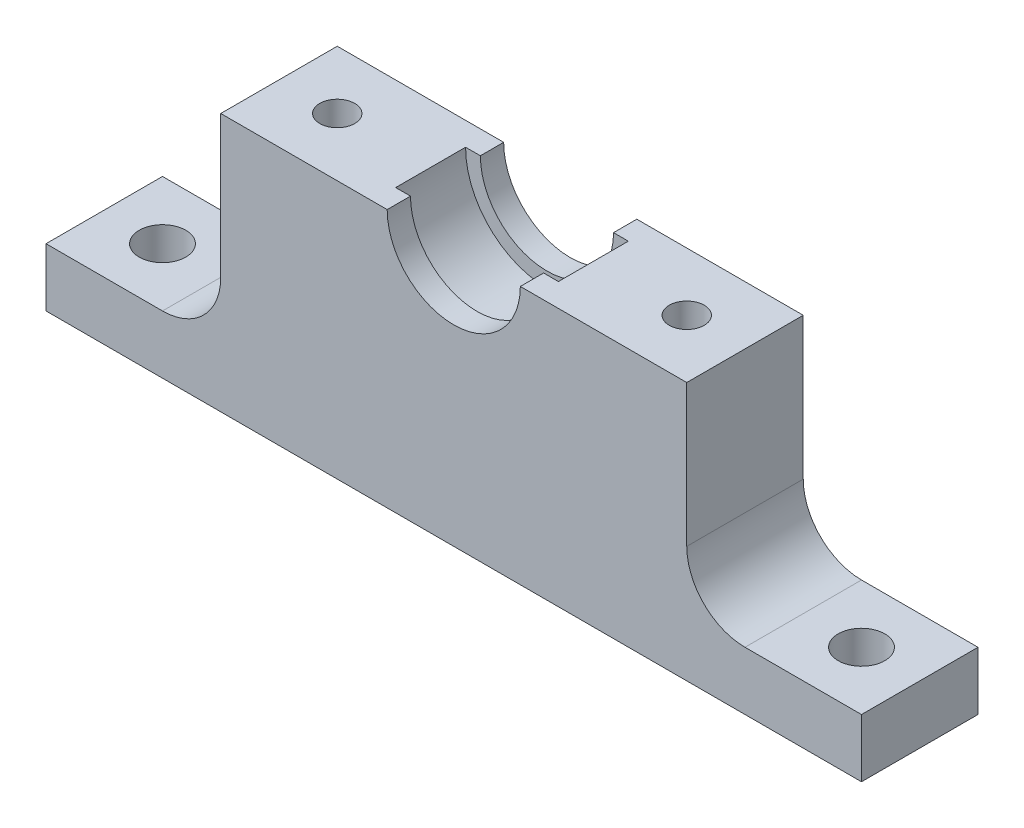
ISO-10303-21;
HEADER;
FILE_DESCRIPTION(('STEP AP214'),'2;1');
FILE_NAME('part.step','',(''),(''),'','','');
FILE_SCHEMA(('AUTOMOTIVE_DESIGN { 1 0 10303 214 1 1 1 1 }'));
ENDSEC;
DATA;
#1=APPLICATION_CONTEXT('core data for automotive mechanical design processes');
#2=APPLICATION_PROTOCOL_DEFINITION('international standard','automotive_design',2000,#1);
#3=PRODUCT_CONTEXT('',#1,'mechanical');
#4=PRODUCT('Part','Part','',(#3));
#5=PRODUCT_RELATED_PRODUCT_CATEGORY('part','',(#4));
#6=PRODUCT_DEFINITION_FORMATION('','',#4);
#7=PRODUCT_DEFINITION_CONTEXT('part definition',#1,'design');
#8=PRODUCT_DEFINITION('design','',#6,#7);
#9=PRODUCT_DEFINITION_SHAPE('','',#8);
#10=(LENGTH_UNIT() NAMED_UNIT(*) SI_UNIT(.MILLI.,.METRE.));
#11=(NAMED_UNIT(*) PLANE_ANGLE_UNIT() SI_UNIT($,.RADIAN.));
#12=(NAMED_UNIT(*) SI_UNIT($,.STERADIAN.) SOLID_ANGLE_UNIT());
#13=UNCERTAINTY_MEASURE_WITH_UNIT(LENGTH_MEASURE(1.E-05),#10,'distance_accuracy_value','');
#14=(GEOMETRIC_REPRESENTATION_CONTEXT(3) GLOBAL_UNCERTAINTY_ASSIGNED_CONTEXT((#13)) GLOBAL_UNIT_ASSIGNED_CONTEXT((#10,
#11,#12)) REPRESENTATION_CONTEXT('',''));
#15=CARTESIAN_POINT('',(0.,0.,0.));
#16=DIRECTION('',(0.,0.,1.));
#17=DIRECTION('',(1.,0.,0.));
#18=AXIS2_PLACEMENT_3D('',#15,#16,#17);
#19=CARTESIAN_POINT('',(0.,22.1798,0.));
#20=DIRECTION('',(0.,1.,0.));
#21=DIRECTION('',(0.,0.,1.));
#22=AXIS2_PLACEMENT_3D('',#19,#20,#21);
#23=PLANE('',#22);
#24=CARTESIAN_POINT('',(15.,22.1798,0.));
#25=DIRECTION('',(0.,1.,0.));
#26=DIRECTION('',(0.,0.,1.));
#27=AXIS2_PLACEMENT_3D('',#24,#25,#26);
#28=CIRCLE('',#27,1.5);
#29=CARTESIAN_POINT('',(15.,22.1798,1.5));
#30=VERTEX_POINT('',#29);
#31=EDGE_CURVE('E224',#30,#30,#28,.T.);
#32=ORIENTED_EDGE('',*,*,#31,.F.);
#33=EDGE_LOOP('',(#32));
#34=FACE_BOUND('',#33,.T.);
#35=DIRECTION('',(0.,0.,-1.));
#36=VECTOR('',#35,1.);
#37=CARTESIAN_POINT('',(5.715,22.1798,5.));
#38=LINE('',#37,#36);
#39=CARTESIAN_POINT('',(5.715,22.1798,5.));
#40=VERTEX_POINT('',#39);
#41=CARTESIAN_POINT('',(5.715,22.1798,3.));
#42=VERTEX_POINT('',#41);
#43=EDGE_CURVE('E242',#40,#42,#38,.T.);
#44=ORIENTED_EDGE('',*,*,#43,.F.);
#45=DIRECTION('',(1.,0.,0.));
#46=VECTOR('',#45,1.);
#47=CARTESIAN_POINT('',(20.,22.1798,5.));
#48=LINE('',#47,#46);
#49=CARTESIAN_POINT('',(20.,22.1798,5.));
#50=VERTEX_POINT('',#49);
#51=EDGE_CURVE('E282',#40,#50,#48,.T.);
#52=ORIENTED_EDGE('',*,*,#51,.T.);
#53=DIRECTION('',(0.,0.,-1.));
#54=VECTOR('',#53,1.);
#55=CARTESIAN_POINT('',(20.,22.1798,5.));
#56=LINE('',#55,#54);
#57=CARTESIAN_POINT('',(20.,22.1798,-5.));
#58=VERTEX_POINT('',#57);
#59=EDGE_CURVE('E288',#50,#58,#56,.T.);
#60=ORIENTED_EDGE('',*,*,#59,.T.);
#61=DIRECTION('',(-1.,0.,0.));
#62=VECTOR('',#61,1.);
#63=CARTESIAN_POINT('',(20.,22.1798,-5.));
#64=LINE('',#63,#62);
#65=CARTESIAN_POINT('',(5.715,22.1798,-5.));
#66=VERTEX_POINT('',#65);
#67=EDGE_CURVE('E292',#58,#66,#64,.T.);
#68=ORIENTED_EDGE('',*,*,#67,.T.);
#69=CARTESIAN_POINT('',(5.715,22.1798,-3.));
#70=VERTEX_POINT('',#69);
#71=EDGE_CURVE('E246',#70,#66,#38,.T.);
#72=ORIENTED_EDGE('',*,*,#71,.F.);
#73=DIRECTION('',(1.,0.,0.));
#74=VECTOR('',#73,1.);
#75=CARTESIAN_POINT('',(6.985,22.1798,-3.));
#76=LINE('',#75,#74);
#77=CARTESIAN_POINT('',(6.985,22.1798,-3.));
#78=VERTEX_POINT('',#77);
#79=EDGE_CURVE('E267',#70,#78,#76,.T.);
#80=ORIENTED_EDGE('',*,*,#79,.T.);
#81=DIRECTION('',(0.,0.,-1.));
#82=VECTOR('',#81,1.);
#83=CARTESIAN_POINT('',(6.985,22.1798,3.));
#84=LINE('',#83,#82);
#85=CARTESIAN_POINT('',(6.985,22.1798,3.));
#86=VERTEX_POINT('',#85);
#87=EDGE_CURVE('E271',#86,#78,#84,.T.);
#88=ORIENTED_EDGE('',*,*,#87,.F.);
#89=DIRECTION('',(1.,0.,0.));
#90=VECTOR('',#89,1.);
#91=CARTESIAN_POINT('',(6.985,22.1798,3.));
#92=LINE('',#91,#90);
#93=EDGE_CURVE('E258',#42,#86,#92,.T.);
#94=ORIENTED_EDGE('',*,*,#93,.F.);
#95=EDGE_LOOP('',(#44,#52,#60,#68,#72,#80,#88,#94));
#96=FACE_BOUND('',#95,.T.);
#97=ADVANCED_FACE('F39',(#34,#96),#23,.T.);
#98=CARTESIAN_POINT('',(-15.,22.1798,1.02348685082632E-13));
#99=DIRECTION('',(0.,1.,0.));
#100=DIRECTION('',(0.,0.,-1.));
#101=AXIS2_PLACEMENT_3D('',#98,#99,#100);
#102=CIRCLE('',#101,1.5);
#103=CARTESIAN_POINT('',(-15.,22.1798,-1.4999999999999));
#104=VERTEX_POINT('',#103);
#105=EDGE_CURVE('E216',#104,#104,#102,.T.);
#106=ORIENTED_EDGE('',*,*,#105,.F.);
#107=EDGE_LOOP('',(#106));
#108=FACE_BOUND('',#107,.T.);
#109=DIRECTION('',(0.,0.,-1.));
#110=VECTOR('',#109,1.);
#111=CARTESIAN_POINT('',(-5.715,22.1798,5.));
#112=LINE('',#111,#110);
#113=CARTESIAN_POINT('',(-5.715,22.1798,-3.));
#114=VERTEX_POINT('',#113);
#115=CARTESIAN_POINT('',(-5.715,22.1798,-5.));
#116=VERTEX_POINT('',#115);
#117=EDGE_CURVE('E239',#114,#116,#112,.T.);
#118=ORIENTED_EDGE('',*,*,#117,.T.);
#119=CARTESIAN_POINT('',(-20.,22.1798,-5.));
#120=VERTEX_POINT('',#119);
#121=EDGE_CURVE('E291',#116,#120,#64,.T.);
#122=ORIENTED_EDGE('',*,*,#121,.T.);
#123=DIRECTION('',(0.,0.,1.));
#124=VECTOR('',#123,1.);
#125=CARTESIAN_POINT('',(-20.,22.1798,5.));
#126=LINE('',#125,#124);
#127=CARTESIAN_POINT('',(-20.,22.1798,5.));
#128=VERTEX_POINT('',#127);
#129=EDGE_CURVE('E278',#120,#128,#126,.T.);
#130=ORIENTED_EDGE('',*,*,#129,.T.);
#131=CARTESIAN_POINT('',(-5.715,22.1798,5.));
#132=VERTEX_POINT('',#131);
#133=EDGE_CURVE('E284',#128,#132,#48,.T.);
#134=ORIENTED_EDGE('',*,*,#133,.T.);
#135=CARTESIAN_POINT('',(-5.715,22.1798,3.));
#136=VERTEX_POINT('',#135);
#137=EDGE_CURVE('E247',#132,#136,#112,.T.);
#138=ORIENTED_EDGE('',*,*,#137,.T.);
#139=CARTESIAN_POINT('',(-6.985,22.1798,3.));
#140=VERTEX_POINT('',#139);
#141=EDGE_CURVE('E260',#140,#136,#92,.T.);
#142=ORIENTED_EDGE('',*,*,#141,.F.);
#143=DIRECTION('',(0.,0.,-1.));
#144=VECTOR('',#143,1.);
#145=CARTESIAN_POINT('',(-6.985,22.1798,3.));
#146=LINE('',#145,#144);
#147=CARTESIAN_POINT('',(-6.985,22.1798,-3.));
#148=VERTEX_POINT('',#147);
#149=EDGE_CURVE('E264',#140,#148,#146,.T.);
#150=ORIENTED_EDGE('',*,*,#149,.T.);
#151=EDGE_CURVE('E259',#148,#114,#76,.T.);
#152=ORIENTED_EDGE('',*,*,#151,.T.);
#153=EDGE_LOOP('',(#118,#122,#130,#134,#138,#142,#150,#152));
#154=FACE_BOUND('',#153,.T.);
#155=ADVANCED_FACE('F347',(#108,#154),#23,.T.);
#156=CARTESIAN_POINT('',(-20.,22.1798,5.));
#157=DIRECTION('',(1.,0.,0.));
#158=DIRECTION('',(0.,0.,-1.));
#159=AXIS2_PLACEMENT_3D('',#156,#157,#158);
#160=PLANE('',#159);
#161=DIRECTION('',(0.,-1.,0.));
#162=VECTOR('',#161,1.);
#163=CARTESIAN_POINT('',(-20.,22.1798,-5.));
#164=LINE('',#163,#162);
#165=CARTESIAN_POINT('',(-20.,10.,-5.));
#166=VERTEX_POINT('',#165);
#167=EDGE_CURVE('E296',#120,#166,#164,.T.);
#168=ORIENTED_EDGE('',*,*,#167,.T.);
#169=DIRECTION('',(0.,0.,1.));
#170=VECTOR('',#169,1.);
#171=CARTESIAN_POINT('',(-20.,10.,5.));
#172=LINE('',#171,#170);
#173=CARTESIAN_POINT('',(-20.,10.,5.));
#174=VERTEX_POINT('',#173);
#175=EDGE_CURVE('E319',#166,#174,#172,.T.);
#176=ORIENTED_EDGE('',*,*,#175,.T.);
#177=DIRECTION('',(0.,-1.,0.));
#178=VECTOR('',#177,1.);
#179=CARTESIAN_POINT('',(-20.,22.1798,5.));
#180=LINE('',#179,#178);
#181=EDGE_CURVE('E311',#128,#174,#180,.T.);
#182=ORIENTED_EDGE('',*,*,#181,.F.);
#183=ORIENTED_EDGE('',*,*,#129,.F.);
#184=EDGE_LOOP('',(#168,#176,#182,#183));
#185=FACE_BOUND('',#184,.T.);
#186=ADVANCED_FACE('F359',(#185),#160,.F.);
#187=CARTESIAN_POINT('',(20.,22.1798,5.));
#188=DIRECTION('',(0.,0.,-1.));
#189=DIRECTION('',(-1.,0.,0.));
#190=AXIS2_PLACEMENT_3D('',#187,#188,#189);
#191=PLANE('',#190);
#192=ORIENTED_EDGE('',*,*,#51,.F.);
#193=CARTESIAN_POINT('',(0.,22.1798,5.));
#194=DIRECTION('',(0.,0.,-1.));
#195=DIRECTION('',(-1.,0.,0.));
#196=AXIS2_PLACEMENT_3D('',#193,#194,#195);
#197=CIRCLE('',#196,5.715);
#198=EDGE_CURVE('E235',#40,#132,#197,.T.);
#199=ORIENTED_EDGE('',*,*,#198,.T.);
#200=ORIENTED_EDGE('',*,*,#133,.F.);
#201=ORIENTED_EDGE('',*,*,#181,.T.);
#202=CARTESIAN_POINT('',(-25.,10.,5.));
#203=DIRECTION('',(0.,0.,-1.));
#204=DIRECTION('',(-1.,0.,0.));
#205=AXIS2_PLACEMENT_3D('',#202,#203,#204);
#206=CIRCLE('',#205,5.);
#207=CARTESIAN_POINT('',(-25.,5.,5.));
#208=VERTEX_POINT('',#207);
#209=EDGE_CURVE('E332',#174,#208,#206,.T.);
#210=ORIENTED_EDGE('',*,*,#209,.T.);
#211=DIRECTION('',(-1.,0.,0.));
#212=VECTOR('',#211,1.);
#213=CARTESIAN_POINT('',(-35.,5.,5.));
#214=LINE('',#213,#212);
#215=CARTESIAN_POINT('',(-35.,5.,5.));
#216=VERTEX_POINT('',#215);
#217=EDGE_CURVE('E197',#208,#216,#214,.T.);
#218=ORIENTED_EDGE('',*,*,#217,.T.);
#219=DIRECTION('',(0.,-1.,0.));
#220=VECTOR('',#219,1.);
#221=CARTESIAN_POINT('',(-35.,5.,5.));
#222=LINE('',#221,#220);
#223=CARTESIAN_POINT('',(-35.,0.,5.));
#224=VERTEX_POINT('',#223);
#225=EDGE_CURVE('E208',#216,#224,#222,.T.);
#226=ORIENTED_EDGE('',*,*,#225,.T.);
#227=DIRECTION('',(1.,0.,0.));
#228=VECTOR('',#227,1.);
#229=CARTESIAN_POINT('',(20.,0.,5.));
#230=LINE('',#229,#228);
#231=CARTESIAN_POINT('',(35.,0.,5.00000000000024));
#232=VERTEX_POINT('',#231);
#233=EDGE_CURVE('E157',#224,#232,#230,.T.);
#234=ORIENTED_EDGE('',*,*,#233,.T.);
#235=DIRECTION('',(0.,-1.,0.));
#236=VECTOR('',#235,1.);
#237=CARTESIAN_POINT('',(35.,5.,5.00000000000024));
#238=LINE('',#237,#236);
#239=CARTESIAN_POINT('',(35.,5.,5.00000000000024));
#240=VERTEX_POINT('',#239);
#241=EDGE_CURVE('E151',#240,#232,#238,.T.);
#242=ORIENTED_EDGE('',*,*,#241,.F.);
#243=DIRECTION('',(-1.,0.,0.));
#244=VECTOR('',#243,1.);
#245=CARTESIAN_POINT('',(35.,5.,5.00000000000024));
#246=LINE('',#245,#244);
#247=CARTESIAN_POINT('',(25.,5.,5.00000000000017));
#248=VERTEX_POINT('',#247);
#249=EDGE_CURVE('E154',#240,#248,#246,.T.);
#250=ORIENTED_EDGE('',*,*,#249,.T.);
#251=CARTESIAN_POINT('',(25.,10.,5.));
#252=DIRECTION('',(0.,0.,-1.));
#253=DIRECTION('',(-1.,0.,0.));
#254=AXIS2_PLACEMENT_3D('',#251,#252,#253);
#255=CIRCLE('',#254,5.);
#256=CARTESIAN_POINT('',(20.,10.,5.));
#257=VERTEX_POINT('',#256);
#258=EDGE_CURVE('E11',#248,#257,#255,.T.);
#259=ORIENTED_EDGE('',*,*,#258,.T.);
#260=DIRECTION('',(0.,-1.,0.));
#261=VECTOR('',#260,1.);
#262=CARTESIAN_POINT('',(20.,22.1798,5.));
#263=LINE('',#262,#261);
#264=EDGE_CURVE('E307',#50,#257,#263,.T.);
#265=ORIENTED_EDGE('',*,*,#264,.F.);
#266=EDGE_LOOP('',(#192,#199,#200,#201,#210,#218,#226,#234,#242,#250,#259,#265));
#267=FACE_BOUND('',#266,.T.);
#268=ADVANCED_FACE('F153',(#267),#191,.F.);
#269=CARTESIAN_POINT('',(20.,22.1798,5.));
#270=DIRECTION('',(-1.,0.,0.));
#271=DIRECTION('',(0.,0.,1.));
#272=AXIS2_PLACEMENT_3D('',#269,#270,#271);
#273=PLANE('',#272);
#274=ORIENTED_EDGE('',*,*,#264,.T.);
#275=DIRECTION('',(0.,0.,-1.));
#276=VECTOR('',#275,1.);
#277=CARTESIAN_POINT('',(20.,10.,5.));
#278=LINE('',#277,#276);
#279=CARTESIAN_POINT('',(20.,10.,-5.));
#280=VERTEX_POINT('',#279);
#281=EDGE_CURVE('E326',#257,#280,#278,.T.);
#282=ORIENTED_EDGE('',*,*,#281,.T.);
#283=DIRECTION('',(0.,-1.,0.));
#284=VECTOR('',#283,1.);
#285=CARTESIAN_POINT('',(20.,22.1798,-5.));
#286=LINE('',#285,#284);
#287=EDGE_CURVE('E304',#58,#280,#286,.T.);
#288=ORIENTED_EDGE('',*,*,#287,.F.);
#289=ORIENTED_EDGE('',*,*,#59,.F.);
#290=EDGE_LOOP('',(#274,#282,#288,#289));
#291=FACE_BOUND('',#290,.T.);
#292=ADVANCED_FACE('F383',(#291),#273,.F.);
#293=CARTESIAN_POINT('',(20.,22.1798,-5.));
#294=DIRECTION('',(0.,0.,1.));
#295=DIRECTION('',(1.,0.,0.));
#296=AXIS2_PLACEMENT_3D('',#293,#294,#295);
#297=PLANE('',#296);
#298=ORIENTED_EDGE('',*,*,#121,.F.);
#299=CARTESIAN_POINT('',(0.,22.1798,-5.));
#300=DIRECTION('',(0.,0.,-1.));
#301=DIRECTION('',(-1.,0.,0.));
#302=AXIS2_PLACEMENT_3D('',#299,#300,#301);
#303=CIRCLE('',#302,5.715);
#304=EDGE_CURVE('E223',#66,#116,#303,.T.);
#305=ORIENTED_EDGE('',*,*,#304,.F.);
#306=ORIENTED_EDGE('',*,*,#67,.F.);
#307=ORIENTED_EDGE('',*,*,#287,.T.);
#308=CARTESIAN_POINT('',(25.,10.,-5.));
#309=DIRECTION('',(0.,0.,1.));
#310=DIRECTION('',(1.,0.,0.));
#311=AXIS2_PLACEMENT_3D('',#308,#309,#310);
#312=CIRCLE('',#311,5.);
#313=CARTESIAN_POINT('',(25.,5.,-4.99999999999983));
#314=VERTEX_POINT('',#313);
#315=EDGE_CURVE('E48',#280,#314,#312,.T.);
#316=ORIENTED_EDGE('',*,*,#315,.T.);
#317=DIRECTION('',(1.,0.,0.));
#318=VECTOR('',#317,1.);
#319=CARTESIAN_POINT('',(35.,5.,-4.99999999999976));
#320=LINE('',#319,#318);
#321=CARTESIAN_POINT('',(35.,5.,-4.99999999999976));
#322=VERTEX_POINT('',#321);
#323=EDGE_CURVE('E164',#314,#322,#320,.T.);
#324=ORIENTED_EDGE('',*,*,#323,.T.);
#325=DIRECTION('',(0.,-1.,0.));
#326=VECTOR('',#325,1.);
#327=CARTESIAN_POINT('',(35.,5.,-4.99999999999976));
#328=LINE('',#327,#326);
#329=CARTESIAN_POINT('',(35.,0.,-4.99999999999976));
#330=VERTEX_POINT('',#329);
#331=EDGE_CURVE('E163',#322,#330,#328,.T.);
#332=ORIENTED_EDGE('',*,*,#331,.T.);
#333=DIRECTION('',(-1.,0.,0.));
#334=VECTOR('',#333,1.);
#335=CARTESIAN_POINT('',(20.,0.,-5.));
#336=LINE('',#335,#334);
#337=CARTESIAN_POINT('',(-35.,0.,-5.));
#338=VERTEX_POINT('',#337);
#339=EDGE_CURVE('E283',#330,#338,#336,.T.);
#340=ORIENTED_EDGE('',*,*,#339,.T.);
#341=DIRECTION('',(0.,-1.,0.));
#342=VECTOR('',#341,1.);
#343=CARTESIAN_POINT('',(-35.,5.,-5.));
#344=LINE('',#343,#342);
#345=CARTESIAN_POINT('',(-35.,5.,-5.));
#346=VERTEX_POINT('',#345);
#347=EDGE_CURVE('E212',#346,#338,#344,.T.);
#348=ORIENTED_EDGE('',*,*,#347,.F.);
#349=DIRECTION('',(1.,0.,0.));
#350=VECTOR('',#349,1.);
#351=CARTESIAN_POINT('',(-35.,5.,-5.));
#352=LINE('',#351,#350);
#353=CARTESIAN_POINT('',(-25.,5.,-5.));
#354=VERTEX_POINT('',#353);
#355=EDGE_CURVE('E204',#346,#354,#352,.T.);
#356=ORIENTED_EDGE('',*,*,#355,.T.);
#357=CARTESIAN_POINT('',(-25.,10.,-5.));
#358=DIRECTION('',(0.,0.,1.));
#359=DIRECTION('',(1.,0.,0.));
#360=AXIS2_PLACEMENT_3D('',#357,#358,#359);
#361=CIRCLE('',#360,5.);
#362=EDGE_CURVE('E335',#354,#166,#361,.T.);
#363=ORIENTED_EDGE('',*,*,#362,.T.);
#364=ORIENTED_EDGE('',*,*,#167,.F.);
#365=EDGE_LOOP('',(#298,#305,#306,#307,#316,#324,#332,#340,#348,#356,#363,#364));
#366=FACE_BOUND('',#365,.T.);
#367=ADVANCED_FACE('F352',(#366),#297,.F.);
#368=CARTESIAN_POINT('',(0.,0.,0.));
#369=DIRECTION('',(0.,1.,0.));
#370=DIRECTION('',(0.,0.,1.));
#371=AXIS2_PLACEMENT_3D('',#368,#369,#370);
#372=PLANE('',#371);
#373=ORIENTED_EDGE('',*,*,#233,.F.);
#374=DIRECTION('',(0.,0.,-1.));
#375=VECTOR('',#374,1.);
#376=CARTESIAN_POINT('',(-35.,0.,5.));
#377=LINE('',#376,#375);
#378=EDGE_CURVE('E193',#224,#338,#377,.T.);
#379=ORIENTED_EDGE('',*,*,#378,.T.);
#380=ORIENTED_EDGE('',*,*,#339,.F.);
#381=DIRECTION('',(0.,0.,1.));
#382=VECTOR('',#381,1.);
#383=CARTESIAN_POINT('',(35.,0.,5.00000000000024));
#384=LINE('',#383,#382);
#385=EDGE_CURVE('E175',#330,#232,#384,.T.);
#386=ORIENTED_EDGE('',*,*,#385,.T.);
#387=EDGE_LOOP('',(#373,#379,#380,#386));
#388=FACE_BOUND('',#387,.T.);
#389=CARTESIAN_POINT('',(-30.,0.,0.));
#390=DIRECTION('',(0.,-1.,0.));
#391=DIRECTION('',(0.,0.,-1.));
#392=AXIS2_PLACEMENT_3D('',#389,#390,#391);
#393=CIRCLE('',#392,2.);
#394=CARTESIAN_POINT('',(-30.,0.,-2.));
#395=VERTEX_POINT('',#394);
#396=EDGE_CURVE('E187',#395,#395,#393,.T.);
#397=ORIENTED_EDGE('',*,*,#396,.F.);
#398=EDGE_LOOP('',(#397));
#399=FACE_BOUND('',#398,.T.);
#400=CARTESIAN_POINT('',(30.,0.,2.0643209364124E-13));
#401=DIRECTION('',(0.,-1.,0.));
#402=DIRECTION('',(0.,0.,1.));
#403=AXIS2_PLACEMENT_3D('',#400,#401,#402);
#404=CIRCLE('',#403,2.);
#405=CARTESIAN_POINT('',(30.,0.,2.00000000000021));
#406=VERTEX_POINT('',#405);
#407=EDGE_CURVE('E181',#406,#406,#404,.T.);
#408=ORIENTED_EDGE('',*,*,#407,.F.);
#409=EDGE_LOOP('',(#408));
#410=FACE_BOUND('',#409,.T.);
#411=ADVANCED_FACE('F404',(#388,#399,#410),#372,.F.);
#412=CARTESIAN_POINT('',(0.,22.1798,3.));
#413=DIRECTION('',(0.,0.,-1.));
#414=DIRECTION('',(-1.,0.,0.));
#415=AXIS2_PLACEMENT_3D('',#412,#413,#414);
#416=CYLINDRICAL_SURFACE('',#415,6.985);
#417=CARTESIAN_POINT('',(0.,22.1798,-3.));
#418=DIRECTION('',(0.,0.,-1.));
#419=DIRECTION('',(-1.,0.,0.));
#420=AXIS2_PLACEMENT_3D('',#417,#418,#419);
#421=CIRCLE('',#420,6.985);
#422=EDGE_CURVE('E253',#78,#148,#421,.T.);
#423=ORIENTED_EDGE('',*,*,#422,.T.);
#424=ORIENTED_EDGE('',*,*,#149,.F.);
#425=CARTESIAN_POINT('',(0.,22.1798,3.));
#426=DIRECTION('',(0.,0.,-1.));
#427=DIRECTION('',(-1.,0.,0.));
#428=AXIS2_PLACEMENT_3D('',#425,#426,#427);
#429=CIRCLE('',#428,6.985);
#430=EDGE_CURVE('E254',#86,#140,#429,.T.);
#431=ORIENTED_EDGE('',*,*,#430,.F.);
#432=ORIENTED_EDGE('',*,*,#87,.T.);
#433=EDGE_LOOP('',(#423,#424,#431,#432));
#434=FACE_BOUND('',#433,.T.);
#435=ADVANCED_FACE('F373',(#434),#416,.F.);
#436=CARTESIAN_POINT('',(0.,22.1798,3.));
#437=DIRECTION('',(0.,0.,-1.));
#438=DIRECTION('',(-1.,0.,0.));
#439=AXIS2_PLACEMENT_3D('',#436,#437,#438);
#440=PLANE('',#439);
#441=CARTESIAN_POINT('',(0.,22.1798,3.));
#442=DIRECTION('',(0.,0.,-1.));
#443=DIRECTION('',(-1.,0.,0.));
#444=AXIS2_PLACEMENT_3D('',#441,#442,#443);
#445=CIRCLE('',#444,5.715);
#446=EDGE_CURVE('E245',#42,#136,#445,.T.);
#447=ORIENTED_EDGE('',*,*,#446,.F.);
#448=ORIENTED_EDGE('',*,*,#93,.T.);
#449=ORIENTED_EDGE('',*,*,#430,.T.);
#450=ORIENTED_EDGE('',*,*,#141,.T.);
#451=EDGE_LOOP('',(#447,#448,#449,#450));
#452=FACE_BOUND('',#451,.T.);
#453=ADVANCED_FACE('F371',(#452),#440,.T.);
#454=CARTESIAN_POINT('',(0.,22.1798,-3.));
#455=DIRECTION('',(0.,0.,-1.));
#456=DIRECTION('',(-1.,0.,0.));
#457=AXIS2_PLACEMENT_3D('',#454,#455,#456);
#458=PLANE('',#457);
#459=ORIENTED_EDGE('',*,*,#79,.F.);
#460=CARTESIAN_POINT('',(0.,22.1798,-3.));
#461=DIRECTION('',(0.,0.,-1.));
#462=DIRECTION('',(-1.,0.,0.));
#463=AXIS2_PLACEMENT_3D('',#460,#461,#462);
#464=CIRCLE('',#463,5.715);
#465=EDGE_CURVE('E315',#70,#114,#464,.T.);
#466=ORIENTED_EDGE('',*,*,#465,.T.);
#467=ORIENTED_EDGE('',*,*,#151,.F.);
#468=ORIENTED_EDGE('',*,*,#422,.F.);
#469=EDGE_LOOP('',(#459,#466,#467,#468));
#470=FACE_BOUND('',#469,.T.);
#471=ADVANCED_FACE('F377',(#470),#458,.F.);
#472=CARTESIAN_POINT('',(0.,22.1798,5.));
#473=DIRECTION('',(0.,0.,-1.));
#474=DIRECTION('',(-1.,0.,0.));
#475=AXIS2_PLACEMENT_3D('',#472,#473,#474);
#476=CYLINDRICAL_SURFACE('',#475,5.715);
#477=ORIENTED_EDGE('',*,*,#71,.T.);
#478=ORIENTED_EDGE('',*,*,#304,.T.);
#479=ORIENTED_EDGE('',*,*,#117,.F.);
#480=ORIENTED_EDGE('',*,*,#465,.F.);
#481=EDGE_LOOP('',(#477,#478,#479,#480));
#482=FACE_BOUND('',#481,.T.);
#483=ADVANCED_FACE('F379',(#482),#476,.F.);
#484=ORIENTED_EDGE('',*,*,#446,.T.);
#485=ORIENTED_EDGE('',*,*,#137,.F.);
#486=ORIENTED_EDGE('',*,*,#198,.F.);
#487=ORIENTED_EDGE('',*,*,#43,.T.);
#488=EDGE_LOOP('',(#484,#485,#486,#487));
#489=FACE_BOUND('',#488,.T.);
#490=ADVANCED_FACE('F364',(#489),#476,.F.);
#491=CARTESIAN_POINT('',(-15.,15.1798,1.02348685082632E-13));
#492=DIRECTION('',(0.,1.,0.));
#493=DIRECTION('',(0.,0.,1.));
#494=AXIS2_PLACEMENT_3D('',#491,#492,#493);
#495=CYLINDRICAL_SURFACE('',#494,1.5);
#496=CARTESIAN_POINT('',(-15.,15.1798,1.02348685082632E-13));
#497=DIRECTION('',(0.,1.,0.));
#498=DIRECTION('',(0.,0.,-1.));
#499=AXIS2_PLACEMENT_3D('',#496,#497,#498);
#500=CIRCLE('',#499,1.5);
#501=CARTESIAN_POINT('',(-15.,15.1798,-1.4999999999999));
#502=VERTEX_POINT('',#501);
#503=EDGE_CURVE('E228',#502,#502,#500,.T.);
#504=ORIENTED_EDGE('',*,*,#503,.F.);
#505=EDGE_LOOP('',(#504));
#506=FACE_BOUND('',#505,.T.);
#507=ORIENTED_EDGE('',*,*,#105,.T.);
#508=EDGE_LOOP('',(#507));
#509=FACE_BOUND('',#508,.T.);
#510=ADVANCED_FACE('F467',(#506,#509),#495,.F.);
#511=CARTESIAN_POINT('',(-15.,15.1798,1.02348685082632E-13));
#512=DIRECTION('',(0.,-1.,0.));
#513=DIRECTION('',(0.,0.,-1.));
#514=AXIS2_PLACEMENT_3D('',#511,#512,#513);
#515=PLANE('',#514);
#516=ORIENTED_EDGE('',*,*,#503,.T.);
#517=EDGE_LOOP('',(#516));
#518=FACE_BOUND('',#517,.T.);
#519=ADVANCED_FACE('F473',(#518),#515,.F.);
#520=CARTESIAN_POINT('',(15.,15.1798,0.));
#521=DIRECTION('',(0.,1.,0.));
#522=DIRECTION('',(0.,0.,1.));
#523=AXIS2_PLACEMENT_3D('',#520,#521,#522);
#524=CYLINDRICAL_SURFACE('',#523,1.5);
#525=CARTESIAN_POINT('',(15.,15.1798,0.));
#526=DIRECTION('',(0.,1.,0.));
#527=DIRECTION('',(0.,0.,1.));
#528=AXIS2_PLACEMENT_3D('',#525,#526,#527);
#529=CIRCLE('',#528,1.5);
#530=CARTESIAN_POINT('',(15.,15.1798,1.5));
#531=VERTEX_POINT('',#530);
#532=EDGE_CURVE('E219',#531,#531,#529,.T.);
#533=ORIENTED_EDGE('',*,*,#532,.F.);
#534=EDGE_LOOP('',(#533));
#535=FACE_BOUND('',#534,.T.);
#536=ORIENTED_EDGE('',*,*,#31,.T.);
#537=EDGE_LOOP('',(#536));
#538=FACE_BOUND('',#537,.T.);
#539=ADVANCED_FACE('F481',(#535,#538),#524,.F.);
#540=CARTESIAN_POINT('',(15.,15.1798,0.));
#541=DIRECTION('',(0.,1.,0.));
#542=DIRECTION('',(0.,0.,1.));
#543=AXIS2_PLACEMENT_3D('',#540,#541,#542);
#544=PLANE('',#543);
#545=ORIENTED_EDGE('',*,*,#532,.T.);
#546=EDGE_LOOP('',(#545));
#547=FACE_BOUND('',#546,.T.);
#548=ADVANCED_FACE('F489',(#547),#544,.T.);
#549=CARTESIAN_POINT('',(-35.,5.,5.));
#550=DIRECTION('',(-1.,0.,0.));
#551=DIRECTION('',(0.,0.,1.));
#552=AXIS2_PLACEMENT_3D('',#549,#550,#551);
#553=PLANE('',#552);
#554=ORIENTED_EDGE('',*,*,#378,.F.);
#555=ORIENTED_EDGE('',*,*,#225,.F.);
#556=DIRECTION('',(0.,0.,-1.));
#557=VECTOR('',#556,1.);
#558=CARTESIAN_POINT('',(-35.,5.,5.));
#559=LINE('',#558,#557);
#560=EDGE_CURVE('E200',#216,#346,#559,.T.);
#561=ORIENTED_EDGE('',*,*,#560,.T.);
#562=ORIENTED_EDGE('',*,*,#347,.T.);
#563=EDGE_LOOP('',(#554,#555,#561,#562));
#564=FACE_BOUND('',#563,.T.);
#565=ADVANCED_FACE('F496',(#564),#553,.T.);
#566=CARTESIAN_POINT('',(0.,5.,0.));
#567=DIRECTION('',(0.,-1.,0.));
#568=DIRECTION('',(0.,0.,-1.));
#569=AXIS2_PLACEMENT_3D('',#566,#567,#568);
#570=PLANE('',#569);
#571=CARTESIAN_POINT('',(-30.,5.,0.));
#572=DIRECTION('',(0.,-1.,0.));
#573=DIRECTION('',(0.,0.,-1.));
#574=AXIS2_PLACEMENT_3D('',#571,#572,#573);
#575=CIRCLE('',#574,2.);
#576=CARTESIAN_POINT('',(-30.,5.,-2.));
#577=VERTEX_POINT('',#576);
#578=EDGE_CURVE('E189',#577,#577,#575,.T.);
#579=ORIENTED_EDGE('',*,*,#578,.T.);
#580=EDGE_LOOP('',(#579));
#581=FACE_BOUND('',#580,.T.);
#582=ORIENTED_EDGE('',*,*,#217,.F.);
#583=DIRECTION('',(0.,0.,1.));
#584=VECTOR('',#583,1.);
#585=CARTESIAN_POINT('',(-25.,5.,-5.));
#586=LINE('',#585,#584);
#587=EDGE_CURVE('E323',#208,#354,#586,.F.);
#588=ORIENTED_EDGE('',*,*,#587,.T.);
#589=ORIENTED_EDGE('',*,*,#355,.F.);
#590=ORIENTED_EDGE('',*,*,#560,.F.);
#591=EDGE_LOOP('',(#582,#588,#589,#590));
#592=FACE_BOUND('',#591,.T.);
#593=ADVANCED_FACE('F503',(#581,#592),#570,.F.);
#594=CARTESIAN_POINT('',(-30.,5.,0.));
#595=DIRECTION('',(0.,-1.,0.));
#596=DIRECTION('',(0.,0.,-1.));
#597=AXIS2_PLACEMENT_3D('',#594,#595,#596);
#598=CYLINDRICAL_SURFACE('',#597,2.);
#599=ORIENTED_EDGE('',*,*,#578,.F.);
#600=EDGE_LOOP('',(#599));
#601=FACE_BOUND('',#600,.T.);
#602=ORIENTED_EDGE('',*,*,#396,.T.);
#603=EDGE_LOOP('',(#602));
#604=FACE_BOUND('',#603,.T.);
#605=ADVANCED_FACE('F511',(#601,#604),#598,.F.);
#606=CARTESIAN_POINT('',(35.,5.,5.00000000000024));
#607=DIRECTION('',(1.,0.,0.));
#608=DIRECTION('',(0.,0.,-1.));
#609=AXIS2_PLACEMENT_3D('',#606,#607,#608);
#610=PLANE('',#609);
#611=ORIENTED_EDGE('',*,*,#385,.F.);
#612=ORIENTED_EDGE('',*,*,#331,.F.);
#613=DIRECTION('',(0.,0.,1.));
#614=VECTOR('',#613,1.);
#615=CARTESIAN_POINT('',(35.,5.,5.00000000000024));
#616=LINE('',#615,#614);
#617=EDGE_CURVE('E168',#322,#240,#616,.T.);
#618=ORIENTED_EDGE('',*,*,#617,.T.);
#619=ORIENTED_EDGE('',*,*,#241,.T.);
#620=EDGE_LOOP('',(#611,#612,#618,#619));
#621=FACE_BOUND('',#620,.T.);
#622=ADVANCED_FACE('F172',(#621),#610,.T.);
#623=CARTESIAN_POINT('',(0.,5.,0.));
#624=DIRECTION('',(0.,1.,0.));
#625=DIRECTION('',(0.,0.,1.));
#626=AXIS2_PLACEMENT_3D('',#623,#624,#625);
#627=PLANE('',#626);
#628=CARTESIAN_POINT('',(30.,5.,2.0643209364124E-13));
#629=DIRECTION('',(0.,-1.,0.));
#630=DIRECTION('',(0.,0.,1.));
#631=AXIS2_PLACEMENT_3D('',#628,#629,#630);
#632=CIRCLE('',#631,2.);
#633=CARTESIAN_POINT('',(30.,5.,2.00000000000021));
#634=VERTEX_POINT('',#633);
#635=EDGE_CURVE('E178',#634,#634,#632,.T.);
#636=ORIENTED_EDGE('',*,*,#635,.T.);
#637=EDGE_LOOP('',(#636));
#638=FACE_BOUND('',#637,.T.);
#639=ORIENTED_EDGE('',*,*,#323,.F.);
#640=DIRECTION('',(0.,0.,-1.));
#641=VECTOR('',#640,1.);
#642=CARTESIAN_POINT('',(25.,5.,0.));
#643=LINE('',#642,#641);
#644=EDGE_CURVE('E55',#314,#248,#643,.F.);
#645=ORIENTED_EDGE('',*,*,#644,.T.);
#646=ORIENTED_EDGE('',*,*,#249,.F.);
#647=ORIENTED_EDGE('',*,*,#617,.F.);
#648=EDGE_LOOP('',(#639,#645,#646,#647));
#649=FACE_BOUND('',#648,.T.);
#650=ADVANCED_FACE('F167',(#638,#649),#627,.T.);
#651=CARTESIAN_POINT('',(30.,5.,2.0643209364124E-13));
#652=DIRECTION('',(0.,-1.,0.));
#653=DIRECTION('',(0.,0.,-1.));
#654=AXIS2_PLACEMENT_3D('',#651,#652,#653);
#655=CYLINDRICAL_SURFACE('',#654,2.);
#656=ORIENTED_EDGE('',*,*,#635,.F.);
#657=EDGE_LOOP('',(#656));
#658=FACE_BOUND('',#657,.T.);
#659=ORIENTED_EDGE('',*,*,#407,.T.);
#660=EDGE_LOOP('',(#659));
#661=FACE_BOUND('',#660,.T.);
#662=ADVANCED_FACE('F391',(#658,#661),#655,.F.);
#663=CARTESIAN_POINT('',(-25.,10.,5.));
#664=DIRECTION('',(0.,0.,-1.));
#665=DIRECTION('',(-1.,0.,0.));
#666=AXIS2_PLACEMENT_3D('',#663,#664,#665);
#667=CYLINDRICAL_SURFACE('',#666,5.);
#668=ORIENTED_EDGE('',*,*,#362,.F.);
#669=ORIENTED_EDGE('',*,*,#587,.F.);
#670=ORIENTED_EDGE('',*,*,#209,.F.);
#671=ORIENTED_EDGE('',*,*,#175,.F.);
#672=EDGE_LOOP('',(#668,#669,#670,#671));
#673=FACE_BOUND('',#672,.T.);
#674=ADVANCED_FACE('F387',(#673),#667,.F.);
#675=CARTESIAN_POINT('',(25.,10.,5.));
#676=DIRECTION('',(0.,0.,-1.));
#677=DIRECTION('',(-1.,0.,0.));
#678=AXIS2_PLACEMENT_3D('',#675,#676,#677);
#679=CYLINDRICAL_SURFACE('',#678,5.);
#680=ORIENTED_EDGE('',*,*,#258,.F.);
#681=ORIENTED_EDGE('',*,*,#644,.F.);
#682=ORIENTED_EDGE('',*,*,#315,.F.);
#683=ORIENTED_EDGE('',*,*,#281,.F.);
#684=EDGE_LOOP('',(#680,#681,#682,#683));
#685=FACE_BOUND('',#684,.T.);
#686=ADVANCED_FACE('F41',(#685),#679,.F.);
#687=CLOSED_SHELL('',(#97,#155,#186,#268,#292,#367,#411,#435,#453,#471,#483,#490,#510,#519,#539,
#548,#565,#593,#605,#622,#650,#662,#674,#686));
#688=MANIFOLD_SOLID_BREP('B2',#687);
#689=ADVANCED_BREP_SHAPE_REPRESENTATION('',(#18,#688),#14);
#690=SHAPE_DEFINITION_REPRESENTATION(#9,#689);
ENDSEC;
END-ISO-10303-21;
